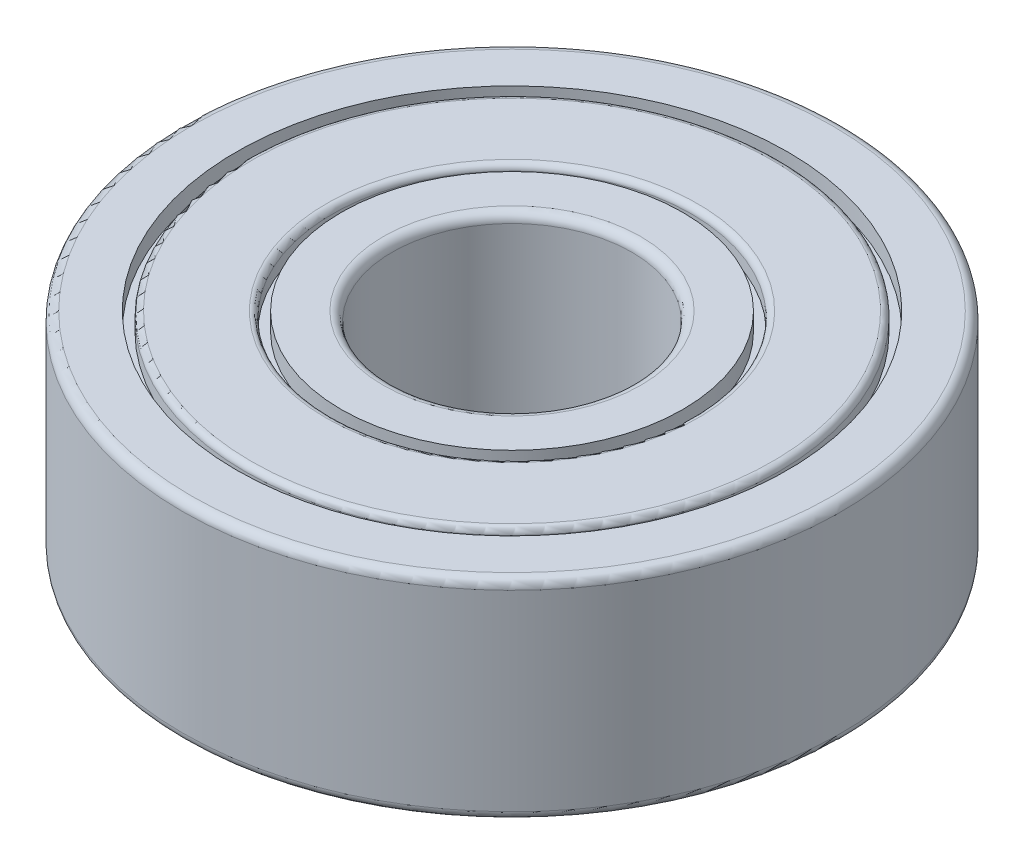
ISO-10303-21;
HEADER;
FILE_DESCRIPTION(('STEP AP214'),'2;1');
FILE_NAME('part.step','',(''),(''),'','','');
FILE_SCHEMA(('AUTOMOTIVE_DESIGN { 1 0 10303 214 1 1 1 1 }'));
ENDSEC;
DATA;
#1=APPLICATION_CONTEXT('core data for automotive mechanical design processes');
#2=APPLICATION_PROTOCOL_DEFINITION('international standard','automotive_design',2000,#1);
#3=PRODUCT_CONTEXT('',#1,'mechanical');
#4=PRODUCT('Part','Part','',(#3));
#5=PRODUCT_RELATED_PRODUCT_CATEGORY('part','',(#4));
#6=PRODUCT_DEFINITION_FORMATION('','',#4);
#7=PRODUCT_DEFINITION_CONTEXT('part definition',#1,'design');
#8=PRODUCT_DEFINITION('design','',#6,#7);
#9=PRODUCT_DEFINITION_SHAPE('','',#8);
#10=(LENGTH_UNIT() NAMED_UNIT(*) SI_UNIT(.MILLI.,.METRE.));
#11=(NAMED_UNIT(*) PLANE_ANGLE_UNIT() SI_UNIT($,.RADIAN.));
#12=(NAMED_UNIT(*) SI_UNIT($,.STERADIAN.) SOLID_ANGLE_UNIT());
#13=UNCERTAINTY_MEASURE_WITH_UNIT(LENGTH_MEASURE(1.E-05),#10,'distance_accuracy_value','');
#14=(GEOMETRIC_REPRESENTATION_CONTEXT(3) GLOBAL_UNCERTAINTY_ASSIGNED_CONTEXT((#13)) GLOBAL_UNIT_ASSIGNED_CONTEXT((#10,
#11,#12)) REPRESENTATION_CONTEXT('',''));
#15=CARTESIAN_POINT('',(0.,0.,0.));
#16=DIRECTION('',(0.,0.,1.));
#17=DIRECTION('',(1.,0.,0.));
#18=AXIS2_PLACEMENT_3D('',#15,#16,#17);
#19=CARTESIAN_POINT('',(0.,3.2,0.));
#20=DIRECTION('',(0.,-1.,0.));
#21=DIRECTION('',(0.,0.,-1.));
#22=AXIS2_PLACEMENT_3D('',#19,#20,#21);
#23=CYLINDRICAL_SURFACE('',#22,4.);
#24=CARTESIAN_POINT('',(0.,-3.20000000000001,0.));
#25=DIRECTION('',(0.,-1.,0.));
#26=DIRECTION('',(0.,0.,1.));
#27=AXIS2_PLACEMENT_3D('',#24,#25,#26);
#28=CIRCLE('',#27,4.);
#29=CARTESIAN_POINT('',(0.,-3.2,4.));
#30=VERTEX_POINT('',#29);
#31=EDGE_CURVE('E274',#30,#30,#28,.F.);
#32=ORIENTED_EDGE('',*,*,#31,.F.);
#33=EDGE_LOOP('',(#32));
#34=FACE_BOUND('',#33,.T.);
#35=CARTESIAN_POINT('',(0.,3.2,0.));
#36=DIRECTION('',(0.,-1.,0.));
#37=DIRECTION('',(0.,0.,1.));
#38=AXIS2_PLACEMENT_3D('',#35,#36,#37);
#39=CIRCLE('',#38,4.);
#40=CARTESIAN_POINT('',(0.,3.2,4.));
#41=VERTEX_POINT('',#40);
#42=EDGE_CURVE('E278',#41,#41,#39,.F.);
#43=ORIENTED_EDGE('',*,*,#42,.T.);
#44=EDGE_LOOP('',(#43));
#45=FACE_BOUND('',#44,.T.);
#46=ADVANCED_FACE('F14',(#34,#45),#23,.F.);
#47=CARTESIAN_POINT('',(0.,3.2,0.));
#48=DIRECTION('',(0.,-1.,0.));
#49=DIRECTION('',(0.,0.,1.));
#50=AXIS2_PLACEMENT_3D('',#47,#48,#49);
#51=TOROIDAL_SURFACE('',#50,4.3,0.3);
#52=ORIENTED_EDGE('',*,*,#42,.F.);
#53=EDGE_LOOP('',(#52));
#54=FACE_BOUND('',#53,.T.);
#55=CARTESIAN_POINT('',(0.,3.5,0.));
#56=DIRECTION('',(0.,1.,0.));
#57=DIRECTION('',(0.,0.,1.));
#58=AXIS2_PLACEMENT_3D('',#55,#56,#57);
#59=CIRCLE('',#58,4.3);
#60=CARTESIAN_POINT('',(0.,3.5,4.3));
#61=VERTEX_POINT('',#60);
#62=EDGE_CURVE('E277',#61,#61,#59,.F.);
#63=ORIENTED_EDGE('',*,*,#62,.F.);
#64=EDGE_LOOP('',(#63));
#65=FACE_BOUND('',#64,.T.);
#66=ADVANCED_FACE('F292',(#54,#65),#51,.T.);
#67=CARTESIAN_POINT('',(0.,-3.20000000000001,0.));
#68=DIRECTION('',(0.,-1.,0.));
#69=DIRECTION('',(0.,0.,1.));
#70=AXIS2_PLACEMENT_3D('',#67,#68,#69);
#71=TOROIDAL_SURFACE('',#70,4.3,0.3);
#72=CARTESIAN_POINT('',(0.,-3.50000000000001,0.));
#73=DIRECTION('',(0.,-1.,0.));
#74=DIRECTION('',(0.,0.,1.));
#75=AXIS2_PLACEMENT_3D('',#72,#73,#74);
#76=CIRCLE('',#75,4.3);
#77=CARTESIAN_POINT('',(0.,-3.5,4.3));
#78=VERTEX_POINT('',#77);
#79=EDGE_CURVE('E238',#78,#78,#76,.F.);
#80=ORIENTED_EDGE('',*,*,#79,.F.);
#81=EDGE_LOOP('',(#80));
#82=FACE_BOUND('',#81,.T.);
#83=ORIENTED_EDGE('',*,*,#31,.T.);
#84=EDGE_LOOP('',(#83));
#85=FACE_BOUND('',#84,.T.);
#86=ADVANCED_FACE('F261',(#82,#85),#71,.T.);
#87=CARTESIAN_POINT('',(0.,3.5,0.));
#88=DIRECTION('',(0.,1.,0.));
#89=DIRECTION('',(0.,0.,1.));
#90=AXIS2_PLACEMENT_3D('',#87,#88,#89);
#91=PLANE('',#90);
#92=ORIENTED_EDGE('',*,*,#62,.T.);
#93=EDGE_LOOP('',(#92));
#94=FACE_BOUND('',#93,.T.);
#95=CARTESIAN_POINT('',(0.,3.5,0.));
#96=DIRECTION('',(0.,1.,0.));
#97=DIRECTION('',(0.,0.,1.));
#98=AXIS2_PLACEMENT_3D('',#95,#96,#97);
#99=CIRCLE('',#98,5.7);
#100=CARTESIAN_POINT('',(0.,3.5,5.7));
#101=VERTEX_POINT('',#100);
#102=EDGE_CURVE('E17',#101,#101,#99,.F.);
#103=ORIENTED_EDGE('',*,*,#102,.F.);
#104=EDGE_LOOP('',(#103));
#105=FACE_BOUND('',#104,.T.);
#106=ADVANCED_FACE('F256',(#94,#105),#91,.T.);
#107=CARTESIAN_POINT('',(0.,-3.5,0.));
#108=DIRECTION('',(0.,-1.,0.));
#109=DIRECTION('',(0.,0.,-1.));
#110=AXIS2_PLACEMENT_3D('',#107,#108,#109);
#111=PLANE('',#110);
#112=ORIENTED_EDGE('',*,*,#79,.T.);
#113=EDGE_LOOP('',(#112));
#114=FACE_BOUND('',#113,.T.);
#115=CARTESIAN_POINT('',(0.,-3.50000000000001,0.));
#116=DIRECTION('',(0.,-1.,0.));
#117=DIRECTION('',(0.,0.,-1.));
#118=AXIS2_PLACEMENT_3D('',#115,#116,#117);
#119=CIRCLE('',#118,5.7);
#120=CARTESIAN_POINT('',(0.,-3.50000000000002,-5.69999999999999));
#121=VERTEX_POINT('',#120);
#122=EDGE_CURVE('E335',#121,#121,#119,.F.);
#123=ORIENTED_EDGE('',*,*,#122,.F.);
#124=EDGE_LOOP('',(#123));
#125=FACE_BOUND('',#124,.T.);
#126=ADVANCED_FACE('F245',(#114,#125),#111,.T.);
#127=CARTESIAN_POINT('',(0.,2.9,0.));
#128=DIRECTION('',(0.,1.,0.));
#129=DIRECTION('',(0.,0.,1.));
#130=AXIS2_PLACEMENT_3D('',#127,#128,#129);
#131=CYLINDRICAL_SURFACE('',#130,5.7);
#132=CARTESIAN_POINT('',(0.,2.9,0.));
#133=DIRECTION('',(0.,1.,0.));
#134=DIRECTION('',(0.,0.,1.));
#135=AXIS2_PLACEMENT_3D('',#132,#133,#134);
#136=CIRCLE('',#135,5.7);
#137=CARTESIAN_POINT('',(0.,2.9,5.7));
#138=VERTEX_POINT('',#137);
#139=EDGE_CURVE('E333',#138,#138,#136,.F.);
#140=ORIENTED_EDGE('',*,*,#139,.F.);
#141=EDGE_LOOP('',(#140));
#142=FACE_BOUND('',#141,.T.);
#143=ORIENTED_EDGE('',*,*,#102,.T.);
#144=EDGE_LOOP('',(#143));
#145=FACE_BOUND('',#144,.T.);
#146=ADVANCED_FACE('F255',(#142,#145),#131,.T.);
#147=CARTESIAN_POINT('',(0.,-2.9,0.));
#148=DIRECTION('',(0.,-1.,0.));
#149=DIRECTION('',(0.,0.,-1.));
#150=AXIS2_PLACEMENT_3D('',#147,#148,#149);
#151=CYLINDRICAL_SURFACE('',#150,5.7);
#152=ORIENTED_EDGE('',*,*,#122,.T.);
#153=EDGE_LOOP('',(#152));
#154=FACE_BOUND('',#153,.T.);
#155=CARTESIAN_POINT('',(0.,-2.90000000000001,0.));
#156=DIRECTION('',(0.,-1.,0.));
#157=DIRECTION('',(0.,0.,-1.));
#158=AXIS2_PLACEMENT_3D('',#155,#156,#157);
#159=CIRCLE('',#158,5.7);
#160=CARTESIAN_POINT('',(0.,-2.90000000000002,-5.7));
#161=VERTEX_POINT('',#160);
#162=EDGE_CURVE('E330',#161,#161,#159,.F.);
#163=ORIENTED_EDGE('',*,*,#162,.F.);
#164=EDGE_LOOP('',(#163));
#165=FACE_BOUND('',#164,.T.);
#166=ADVANCED_FACE('F345',(#154,#165),#151,.T.);
#167=CARTESIAN_POINT('',(0.,2.9,0.));
#168=DIRECTION('',(0.,1.,0.));
#169=DIRECTION('',(0.,0.,1.));
#170=AXIS2_PLACEMENT_3D('',#167,#168,#169);
#171=PLANE('',#170);
#172=ORIENTED_EDGE('',*,*,#139,.T.);
#173=EDGE_LOOP('',(#172));
#174=FACE_BOUND('',#173,.T.);
#175=CARTESIAN_POINT('',(0.,2.9,0.));
#176=DIRECTION('',(0.,-1.,0.));
#177=DIRECTION('',(0.,0.,-1.));
#178=AXIS2_PLACEMENT_3D('',#175,#176,#177);
#179=CIRCLE('',#178,6.);
#180=CARTESIAN_POINT('',(0.,2.89999999999999,-6.));
#181=VERTEX_POINT('',#180);
#182=EDGE_CURVE('E327',#181,#181,#179,.F.);
#183=ORIENTED_EDGE('',*,*,#182,.T.);
#184=EDGE_LOOP('',(#183));
#185=FACE_BOUND('',#184,.T.);
#186=ADVANCED_FACE('F351',(#174,#185),#171,.T.);
#187=CARTESIAN_POINT('',(0.,-2.9,0.));
#188=DIRECTION('',(0.,-1.,0.));
#189=DIRECTION('',(0.,0.,-1.));
#190=AXIS2_PLACEMENT_3D('',#187,#188,#189);
#191=PLANE('',#190);
#192=ORIENTED_EDGE('',*,*,#162,.T.);
#193=EDGE_LOOP('',(#192));
#194=FACE_BOUND('',#193,.T.);
#195=CARTESIAN_POINT('',(0.,-2.90000000000001,0.));
#196=DIRECTION('',(0.,1.,0.));
#197=DIRECTION('',(0.,0.,1.));
#198=AXIS2_PLACEMENT_3D('',#195,#196,#197);
#199=CIRCLE('',#198,6.);
#200=CARTESIAN_POINT('',(0.,-2.9,6.));
#201=VERTEX_POINT('',#200);
#202=EDGE_CURVE('E223',#201,#201,#199,.F.);
#203=ORIENTED_EDGE('',*,*,#202,.T.);
#204=EDGE_LOOP('',(#203));
#205=FACE_BOUND('',#204,.T.);
#206=ADVANCED_FACE('F451',(#194,#205),#191,.T.);
#207=CARTESIAN_POINT('',(0.,3.3,0.));
#208=DIRECTION('',(0.,-1.,0.));
#209=DIRECTION('',(0.,0.,-1.));
#210=AXIS2_PLACEMENT_3D('',#207,#208,#209);
#211=CYLINDRICAL_SURFACE('',#210,6.);
#212=CARTESIAN_POINT('',(0.,3.3,0.));
#213=DIRECTION('',(0.,-1.,0.));
#214=DIRECTION('',(0.,0.,1.));
#215=AXIS2_PLACEMENT_3D('',#212,#213,#214);
#216=CIRCLE('',#215,6.);
#217=CARTESIAN_POINT('',(0.,3.3,6.));
#218=VERTEX_POINT('',#217);
#219=EDGE_CURVE('E220',#218,#218,#216,.F.);
#220=ORIENTED_EDGE('',*,*,#219,.T.);
#221=EDGE_LOOP('',(#220));
#222=FACE_BOUND('',#221,.T.);
#223=ORIENTED_EDGE('',*,*,#182,.F.);
#224=EDGE_LOOP('',(#223));
#225=FACE_BOUND('',#224,.T.);
#226=ADVANCED_FACE('F444',(#222,#225),#211,.F.);
#227=CARTESIAN_POINT('',(0.,-3.3,0.));
#228=DIRECTION('',(0.,1.,0.));
#229=DIRECTION('',(0.,0.,1.));
#230=AXIS2_PLACEMENT_3D('',#227,#228,#229);
#231=CYLINDRICAL_SURFACE('',#230,6.);
#232=ORIENTED_EDGE('',*,*,#202,.F.);
#233=EDGE_LOOP('',(#232));
#234=FACE_BOUND('',#233,.T.);
#235=CARTESIAN_POINT('',(0.,-3.30000000000001,0.));
#236=DIRECTION('',(0.,-1.,0.));
#237=DIRECTION('',(0.,0.,1.));
#238=AXIS2_PLACEMENT_3D('',#235,#236,#237);
#239=CIRCLE('',#238,6.);
#240=CARTESIAN_POINT('',(0.,-3.3,6.));
#241=VERTEX_POINT('',#240);
#242=EDGE_CURVE('E198',#241,#241,#239,.F.);
#243=ORIENTED_EDGE('',*,*,#242,.F.);
#244=EDGE_LOOP('',(#243));
#245=FACE_BOUND('',#244,.T.);
#246=ADVANCED_FACE('F437',(#234,#245),#231,.F.);
#247=CARTESIAN_POINT('',(0.,3.3,0.));
#248=DIRECTION('',(0.,-1.,0.));
#249=DIRECTION('',(0.,0.,1.));
#250=AXIS2_PLACEMENT_3D('',#247,#248,#249);
#251=TOROIDAL_SURFACE('',#250,6.2,0.2);
#252=ORIENTED_EDGE('',*,*,#219,.F.);
#253=EDGE_LOOP('',(#252));
#254=FACE_BOUND('',#253,.T.);
#255=CARTESIAN_POINT('',(0.,3.5,0.));
#256=DIRECTION('',(0.,1.,0.));
#257=DIRECTION('',(0.,0.,1.));
#258=AXIS2_PLACEMENT_3D('',#255,#256,#257);
#259=CIRCLE('',#258,6.2);
#260=CARTESIAN_POINT('',(0.,3.5,6.2));
#261=VERTEX_POINT('',#260);
#262=EDGE_CURVE('E177',#261,#261,#259,.F.);
#263=ORIENTED_EDGE('',*,*,#262,.F.);
#264=EDGE_LOOP('',(#263));
#265=FACE_BOUND('',#264,.T.);
#266=ADVANCED_FACE('F204',(#254,#265),#251,.T.);
#267=CARTESIAN_POINT('',(0.,-3.30000000000001,0.));
#268=DIRECTION('',(0.,-1.,0.));
#269=DIRECTION('',(0.,0.,1.));
#270=AXIS2_PLACEMENT_3D('',#267,#268,#269);
#271=TOROIDAL_SURFACE('',#270,6.2,0.2);
#272=CARTESIAN_POINT('',(0.,-3.50000000000001,0.));
#273=DIRECTION('',(0.,-1.,0.));
#274=DIRECTION('',(0.,0.,1.));
#275=AXIS2_PLACEMENT_3D('',#272,#273,#274);
#276=CIRCLE('',#275,6.2);
#277=CARTESIAN_POINT('',(0.,-3.5,6.2));
#278=VERTEX_POINT('',#277);
#279=EDGE_CURVE('E582',#278,#278,#276,.F.);
#280=ORIENTED_EDGE('',*,*,#279,.F.);
#281=EDGE_LOOP('',(#280));
#282=FACE_BOUND('',#281,.T.);
#283=ORIENTED_EDGE('',*,*,#242,.T.);
#284=EDGE_LOOP('',(#283));
#285=FACE_BOUND('',#284,.T.);
#286=ADVANCED_FACE('F200',(#282,#285),#271,.T.);
#287=CARTESIAN_POINT('',(0.,3.5,0.));
#288=DIRECTION('',(0.,1.,0.));
#289=DIRECTION('',(0.,0.,1.));
#290=AXIS2_PLACEMENT_3D('',#287,#288,#289);
#291=PLANE('',#290);
#292=ORIENTED_EDGE('',*,*,#262,.T.);
#293=EDGE_LOOP('',(#292));
#294=FACE_BOUND('',#293,.T.);
#295=CARTESIAN_POINT('',(0.,3.49999999999999,0.));
#296=DIRECTION('',(0.,-1.,0.));
#297=DIRECTION('',(0.,0.,1.));
#298=AXIS2_PLACEMENT_3D('',#295,#296,#297);
#299=CIRCLE('',#298,8.7);
#300=CARTESIAN_POINT('',(0.,3.5,8.7));
#301=VERTEX_POINT('',#300);
#302=EDGE_CURVE('E164',#301,#301,#299,.F.);
#303=ORIENTED_EDGE('',*,*,#302,.T.);
#304=EDGE_LOOP('',(#303));
#305=FACE_BOUND('',#304,.T.);
#306=ADVANCED_FACE('F138',(#294,#305),#291,.T.);
#307=CARTESIAN_POINT('',(0.,-3.5,0.));
#308=DIRECTION('',(0.,-1.,0.));
#309=DIRECTION('',(0.,0.,-1.));
#310=AXIS2_PLACEMENT_3D('',#307,#308,#309);
#311=PLANE('',#310);
#312=ORIENTED_EDGE('',*,*,#279,.T.);
#313=EDGE_LOOP('',(#312));
#314=FACE_BOUND('',#313,.T.);
#315=CARTESIAN_POINT('',(0.,-3.50000000000001,0.));
#316=DIRECTION('',(0.,1.,0.));
#317=DIRECTION('',(0.,0.,1.));
#318=AXIS2_PLACEMENT_3D('',#315,#316,#317);
#319=CIRCLE('',#318,8.69999999999999);
#320=CARTESIAN_POINT('',(0.,-3.5,8.7));
#321=VERTEX_POINT('',#320);
#322=EDGE_CURVE('E123',#321,#321,#319,.T.);
#323=ORIENTED_EDGE('',*,*,#322,.F.);
#324=EDGE_LOOP('',(#323));
#325=FACE_BOUND('',#324,.T.);
#326=ADVANCED_FACE('F129',(#314,#325),#311,.T.);
#327=CARTESIAN_POINT('',(0.,3.29999999999999,0.));
#328=DIRECTION('',(0.,-1.,0.));
#329=DIRECTION('',(0.,0.,1.));
#330=AXIS2_PLACEMENT_3D('',#327,#328,#329);
#331=TOROIDAL_SURFACE('',#330,8.7,0.2);
#332=ORIENTED_EDGE('',*,*,#302,.F.);
#333=EDGE_LOOP('',(#332));
#334=FACE_BOUND('',#333,.T.);
#335=CARTESIAN_POINT('',(0.,3.29999999999999,0.));
#336=DIRECTION('',(0.,1.,0.));
#337=DIRECTION('',(0.,0.,1.));
#338=AXIS2_PLACEMENT_3D('',#335,#336,#337);
#339=CIRCLE('',#338,8.9);
#340=CARTESIAN_POINT('',(0.,3.3,8.9));
#341=VERTEX_POINT('',#340);
#342=EDGE_CURVE('E115',#341,#341,#339,.F.);
#343=ORIENTED_EDGE('',*,*,#342,.F.);
#344=EDGE_LOOP('',(#343));
#345=FACE_BOUND('',#344,.T.);
#346=ADVANCED_FACE('F107',(#334,#345),#331,.T.);
#347=CARTESIAN_POINT('',(0.,-3.30000000000001,0.));
#348=DIRECTION('',(0.,-1.,0.));
#349=DIRECTION('',(0.,0.,1.));
#350=AXIS2_PLACEMENT_3D('',#347,#348,#349);
#351=TOROIDAL_SURFACE('',#350,8.69999999999999,0.2);
#352=CARTESIAN_POINT('',(0.,-3.30000000000001,0.));
#353=DIRECTION('',(0.,-1.,0.));
#354=DIRECTION('',(0.,0.,-1.));
#355=AXIS2_PLACEMENT_3D('',#352,#353,#354);
#356=CIRCLE('',#355,8.9);
#357=CARTESIAN_POINT('',(0.,-3.30000000000003,-8.9));
#358=VERTEX_POINT('',#357);
#359=EDGE_CURVE('E324',#358,#358,#356,.F.);
#360=ORIENTED_EDGE('',*,*,#359,.F.);
#361=EDGE_LOOP('',(#360));
#362=FACE_BOUND('',#361,.T.);
#363=ORIENTED_EDGE('',*,*,#322,.T.);
#364=EDGE_LOOP('',(#363));
#365=FACE_BOUND('',#364,.T.);
#366=ADVANCED_FACE('F101',(#362,#365),#351,.T.);
#367=CARTESIAN_POINT('',(0.,2.9,0.));
#368=DIRECTION('',(0.,1.,0.));
#369=DIRECTION('',(0.,0.,1.));
#370=AXIS2_PLACEMENT_3D('',#367,#368,#369);
#371=CYLINDRICAL_SURFACE('',#370,8.9);
#372=CARTESIAN_POINT('',(0.,2.89999999999999,0.));
#373=DIRECTION('',(0.,1.,0.));
#374=DIRECTION('',(0.,0.,1.));
#375=AXIS2_PLACEMENT_3D('',#372,#373,#374);
#376=CIRCLE('',#375,8.9);
#377=CARTESIAN_POINT('',(0.,2.9,8.9));
#378=VERTEX_POINT('',#377);
#379=EDGE_CURVE('E321',#378,#378,#376,.F.);
#380=ORIENTED_EDGE('',*,*,#379,.F.);
#381=EDGE_LOOP('',(#380));
#382=FACE_BOUND('',#381,.T.);
#383=ORIENTED_EDGE('',*,*,#342,.T.);
#384=EDGE_LOOP('',(#383));
#385=FACE_BOUND('',#384,.T.);
#386=ADVANCED_FACE('F97',(#382,#385),#371,.T.);
#387=CARTESIAN_POINT('',(0.,-2.9,0.));
#388=DIRECTION('',(0.,-1.,0.));
#389=DIRECTION('',(0.,0.,-1.));
#390=AXIS2_PLACEMENT_3D('',#387,#388,#389);
#391=CYLINDRICAL_SURFACE('',#390,8.9);
#392=ORIENTED_EDGE('',*,*,#359,.T.);
#393=EDGE_LOOP('',(#392));
#394=FACE_BOUND('',#393,.T.);
#395=CARTESIAN_POINT('',(0.,-2.90000000000001,0.));
#396=DIRECTION('',(0.,-1.,0.));
#397=DIRECTION('',(0.,0.,-1.));
#398=AXIS2_PLACEMENT_3D('',#395,#396,#397);
#399=CIRCLE('',#398,8.9);
#400=CARTESIAN_POINT('',(0.,-2.90000000000003,-8.9));
#401=VERTEX_POINT('',#400);
#402=EDGE_CURVE('E318',#401,#401,#399,.F.);
#403=ORIENTED_EDGE('',*,*,#402,.F.);
#404=EDGE_LOOP('',(#403));
#405=FACE_BOUND('',#404,.T.);
#406=ADVANCED_FACE('F93',(#394,#405),#391,.T.);
#407=CARTESIAN_POINT('',(0.,2.9,0.));
#408=DIRECTION('',(0.,1.,0.));
#409=DIRECTION('',(0.,0.,1.));
#410=AXIS2_PLACEMENT_3D('',#407,#408,#409);
#411=PLANE('',#410);
#412=ORIENTED_EDGE('',*,*,#379,.T.);
#413=EDGE_LOOP('',(#412));
#414=FACE_BOUND('',#413,.T.);
#415=CARTESIAN_POINT('',(0.,2.89999999999999,0.));
#416=DIRECTION('',(0.,-1.,0.));
#417=DIRECTION('',(0.,0.,-1.));
#418=AXIS2_PLACEMENT_3D('',#415,#416,#417);
#419=CIRCLE('',#418,9.2);
#420=CARTESIAN_POINT('',(0.,2.89999999999999,-9.2));
#421=VERTEX_POINT('',#420);
#422=EDGE_CURVE('E315',#421,#421,#419,.F.);
#423=ORIENTED_EDGE('',*,*,#422,.T.);
#424=EDGE_LOOP('',(#423));
#425=FACE_BOUND('',#424,.T.);
#426=ADVANCED_FACE('F89',(#414,#425),#411,.T.);
#427=CARTESIAN_POINT('',(0.,-2.9,0.));
#428=DIRECTION('',(0.,-1.,0.));
#429=DIRECTION('',(0.,0.,-1.));
#430=AXIS2_PLACEMENT_3D('',#427,#428,#429);
#431=PLANE('',#430);
#432=ORIENTED_EDGE('',*,*,#402,.T.);
#433=EDGE_LOOP('',(#432));
#434=FACE_BOUND('',#433,.T.);
#435=CARTESIAN_POINT('',(0.,-2.90000000000001,0.));
#436=DIRECTION('',(0.,1.,0.));
#437=DIRECTION('',(0.,0.,1.));
#438=AXIS2_PLACEMENT_3D('',#435,#436,#437);
#439=CIRCLE('',#438,9.2);
#440=CARTESIAN_POINT('',(0.,-2.9,9.2));
#441=VERTEX_POINT('',#440);
#442=EDGE_CURVE('E312',#441,#441,#439,.F.);
#443=ORIENTED_EDGE('',*,*,#442,.T.);
#444=EDGE_LOOP('',(#443));
#445=FACE_BOUND('',#444,.T.);
#446=ADVANCED_FACE('F85',(#434,#445),#431,.T.);
#447=CARTESIAN_POINT('',(0.,3.5,0.));
#448=DIRECTION('',(0.,-1.,0.));
#449=DIRECTION('',(0.,0.,-1.));
#450=AXIS2_PLACEMENT_3D('',#447,#448,#449);
#451=CYLINDRICAL_SURFACE('',#450,9.2);
#452=CARTESIAN_POINT('',(0.,3.49999999999999,0.));
#453=DIRECTION('',(0.,-1.,0.));
#454=DIRECTION('',(0.,0.,-1.));
#455=AXIS2_PLACEMENT_3D('',#452,#453,#454);
#456=CIRCLE('',#455,9.2);
#457=CARTESIAN_POINT('',(0.,3.49999999999999,-9.2));
#458=VERTEX_POINT('',#457);
#459=EDGE_CURVE('E309',#458,#458,#456,.T.);
#460=ORIENTED_EDGE('',*,*,#459,.F.);
#461=EDGE_LOOP('',(#460));
#462=FACE_BOUND('',#461,.T.);
#463=ORIENTED_EDGE('',*,*,#422,.F.);
#464=EDGE_LOOP('',(#463));
#465=FACE_BOUND('',#464,.T.);
#466=ADVANCED_FACE('F81',(#462,#465),#451,.F.);
#467=CARTESIAN_POINT('',(0.,-3.5,0.));
#468=DIRECTION('',(0.,1.,0.));
#469=DIRECTION('',(0.,0.,1.));
#470=AXIS2_PLACEMENT_3D('',#467,#468,#469);
#471=CYLINDRICAL_SURFACE('',#470,9.2);
#472=ORIENTED_EDGE('',*,*,#442,.F.);
#473=EDGE_LOOP('',(#472));
#474=FACE_BOUND('',#473,.T.);
#475=CARTESIAN_POINT('',(0.,-3.50000000000001,0.));
#476=DIRECTION('',(0.,1.,0.));
#477=DIRECTION('',(0.,0.,1.));
#478=AXIS2_PLACEMENT_3D('',#475,#476,#477);
#479=CIRCLE('',#478,9.2);
#480=CARTESIAN_POINT('',(0.,-3.5,9.2));
#481=VERTEX_POINT('',#480);
#482=EDGE_CURVE('E301',#481,#481,#479,.T.);
#483=ORIENTED_EDGE('',*,*,#482,.F.);
#484=EDGE_LOOP('',(#483));
#485=FACE_BOUND('',#484,.T.);
#486=ADVANCED_FACE('F76',(#474,#485),#471,.F.);
#487=CARTESIAN_POINT('',(0.,3.5,0.));
#488=DIRECTION('',(0.,1.,0.));
#489=DIRECTION('',(0.,0.,1.));
#490=AXIS2_PLACEMENT_3D('',#487,#488,#489);
#491=PLANE('',#490);
#492=ORIENTED_EDGE('',*,*,#459,.T.);
#493=EDGE_LOOP('',(#492));
#494=FACE_BOUND('',#493,.T.);
#495=CARTESIAN_POINT('',(0.,3.49999999999999,0.));
#496=DIRECTION('',(0.,-1.,0.));
#497=DIRECTION('',(0.,0.,1.));
#498=AXIS2_PLACEMENT_3D('',#495,#496,#497);
#499=CIRCLE('',#498,10.7);
#500=CARTESIAN_POINT('',(0.,3.5,10.7));
#501=VERTEX_POINT('',#500);
#502=EDGE_CURVE('E60',#501,#501,#499,.F.);
#503=ORIENTED_EDGE('',*,*,#502,.T.);
#504=EDGE_LOOP('',(#503));
#505=FACE_BOUND('',#504,.T.);
#506=ADVANCED_FACE('F66',(#494,#505),#491,.T.);
#507=CARTESIAN_POINT('',(0.,-3.5,0.));
#508=DIRECTION('',(0.,-1.,0.));
#509=DIRECTION('',(0.,0.,-1.));
#510=AXIS2_PLACEMENT_3D('',#507,#508,#509);
#511=PLANE('',#510);
#512=ORIENTED_EDGE('',*,*,#482,.T.);
#513=EDGE_LOOP('',(#512));
#514=FACE_BOUND('',#513,.T.);
#515=CARTESIAN_POINT('',(0.,-3.50000000000002,0.));
#516=DIRECTION('',(0.,1.,0.));
#517=DIRECTION('',(0.,0.,1.));
#518=AXIS2_PLACEMENT_3D('',#515,#516,#517);
#519=CIRCLE('',#518,10.7);
#520=CARTESIAN_POINT('',(0.,-3.5,10.7));
#521=VERTEX_POINT('',#520);
#522=EDGE_CURVE('E26',#521,#521,#519,.T.);
#523=ORIENTED_EDGE('',*,*,#522,.F.);
#524=EDGE_LOOP('',(#523));
#525=FACE_BOUND('',#524,.T.);
#526=ADVANCED_FACE('F75',(#514,#525),#511,.T.);
#527=CARTESIAN_POINT('',(0.,3.19999999999999,0.));
#528=DIRECTION('',(0.,-1.,0.));
#529=DIRECTION('',(0.,0.,1.));
#530=AXIS2_PLACEMENT_3D('',#527,#528,#529);
#531=TOROIDAL_SURFACE('',#530,10.7,0.3);
#532=ORIENTED_EDGE('',*,*,#502,.F.);
#533=EDGE_LOOP('',(#532));
#534=FACE_BOUND('',#533,.T.);
#535=CARTESIAN_POINT('',(0.,3.19999999999999,0.));
#536=DIRECTION('',(0.,1.,0.));
#537=DIRECTION('',(0.,0.,1.));
#538=AXIS2_PLACEMENT_3D('',#535,#536,#537);
#539=CIRCLE('',#538,11.);
#540=CARTESIAN_POINT('',(0.,3.2,11.));
#541=VERTEX_POINT('',#540);
#542=EDGE_CURVE('E21',#541,#541,#539,.F.);
#543=ORIENTED_EDGE('',*,*,#542,.F.);
#544=EDGE_LOOP('',(#543));
#545=FACE_BOUND('',#544,.T.);
#546=ADVANCED_FACE('F40',(#534,#545),#531,.T.);
#547=CARTESIAN_POINT('',(0.,-3.20000000000002,0.));
#548=DIRECTION('',(0.,-1.,0.));
#549=DIRECTION('',(0.,0.,1.));
#550=AXIS2_PLACEMENT_3D('',#547,#548,#549);
#551=TOROIDAL_SURFACE('',#550,10.7,0.3);
#552=CARTESIAN_POINT('',(0.,-3.20000000000001,0.));
#553=DIRECTION('',(0.,1.,0.));
#554=DIRECTION('',(0.,0.,1.));
#555=AXIS2_PLACEMENT_3D('',#552,#553,#554);
#556=CIRCLE('',#555,11.);
#557=CARTESIAN_POINT('',(0.,-3.2,11.));
#558=VERTEX_POINT('',#557);
#559=EDGE_CURVE('E10',#558,#558,#556,.T.);
#560=ORIENTED_EDGE('',*,*,#559,.F.);
#561=EDGE_LOOP('',(#560));
#562=FACE_BOUND('',#561,.T.);
#563=ORIENTED_EDGE('',*,*,#522,.T.);
#564=EDGE_LOOP('',(#563));
#565=FACE_BOUND('',#564,.T.);
#566=ADVANCED_FACE('F34',(#562,#565),#551,.T.);
#567=CARTESIAN_POINT('',(0.,0.,0.));
#568=DIRECTION('',(0.,1.,0.));
#569=DIRECTION('',(0.,0.,1.));
#570=AXIS2_PLACEMENT_3D('',#567,#568,#569);
#571=CYLINDRICAL_SURFACE('',#570,11.);
#572=ORIENTED_EDGE('',*,*,#559,.T.);
#573=EDGE_LOOP('',(#572));
#574=FACE_BOUND('',#573,.T.);
#575=ORIENTED_EDGE('',*,*,#542,.T.);
#576=EDGE_LOOP('',(#575));
#577=FACE_BOUND('',#576,.T.);
#578=ADVANCED_FACE('F39',(#574,#577),#571,.T.);
#579=CLOSED_SHELL('',(#46,#66,#86,#106,#126,#146,#166,#186,#206,#226,#246,#266,#286,#306,#326,
#346,#366,#386,#406,#426,#446,#466,#486,#506,#526,#546,#566,#578));
#580=MANIFOLD_SOLID_BREP('B1',#579);
#581=ADVANCED_BREP_SHAPE_REPRESENTATION('',(#18,#580),#14);
#582=SHAPE_DEFINITION_REPRESENTATION(#9,#581);
ENDSEC;
END-ISO-10303-21;
